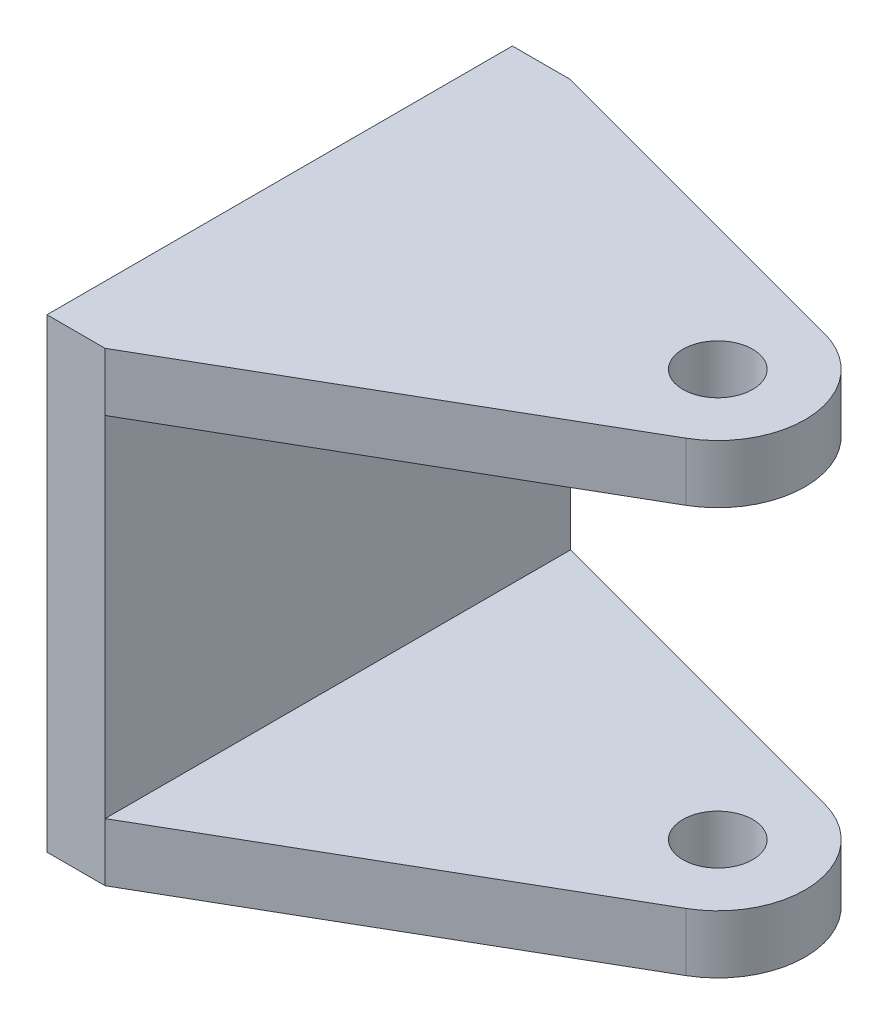
ISO-10303-21;
HEADER;
FILE_DESCRIPTION(('STEP AP214'),'2;1');
FILE_NAME('part.step','',(''),(''),'','','');
FILE_SCHEMA(('AUTOMOTIVE_DESIGN { 1 0 10303 214 1 1 1 1 }'));
ENDSEC;
DATA;
#1=APPLICATION_CONTEXT('core data for automotive mechanical design processes');
#2=APPLICATION_PROTOCOL_DEFINITION('international standard','automotive_design',2000,#1);
#3=PRODUCT_CONTEXT('',#1,'mechanical');
#4=PRODUCT('Part','Part','',(#3));
#5=PRODUCT_RELATED_PRODUCT_CATEGORY('part','',(#4));
#6=PRODUCT_DEFINITION_FORMATION('','',#4);
#7=PRODUCT_DEFINITION_CONTEXT('part definition',#1,'design');
#8=PRODUCT_DEFINITION('design','',#6,#7);
#9=PRODUCT_DEFINITION_SHAPE('','',#8);
#10=(LENGTH_UNIT() NAMED_UNIT(*) SI_UNIT(.MILLI.,.METRE.));
#11=(NAMED_UNIT(*) PLANE_ANGLE_UNIT() SI_UNIT($,.RADIAN.));
#12=(NAMED_UNIT(*) SI_UNIT($,.STERADIAN.) SOLID_ANGLE_UNIT());
#13=UNCERTAINTY_MEASURE_WITH_UNIT(LENGTH_MEASURE(1.E-05),#10,'distance_accuracy_value','');
#14=(GEOMETRIC_REPRESENTATION_CONTEXT(3) GLOBAL_UNCERTAINTY_ASSIGNED_CONTEXT((#13)) GLOBAL_UNIT_ASSIGNED_CONTEXT((#10,
#11,#12)) REPRESENTATION_CONTEXT('',''));
#15=CARTESIAN_POINT('',(0.,0.,0.));
#16=DIRECTION('',(0.,0.,1.));
#17=DIRECTION('',(1.,0.,0.));
#18=AXIS2_PLACEMENT_3D('',#15,#16,#17);
#19=CARTESIAN_POINT('',(65.7794620237371,30.,-9.52479549034592));
#20=DIRECTION('',(0.,1.,0.));
#21=DIRECTION('',(1.,0.,0.));
#22=AXIS2_PLACEMENT_3D('',#19,#20,#21);
#23=PLANE('',#22);
#24=CARTESIAN_POINT('',(65.7794620237371,30.,-9.52479549034592));
#25=DIRECTION('',(0.,-1.,0.));
#26=DIRECTION('',(1.,0.,0.));
#27=AXIS2_PLACEMENT_3D('',#24,#25,#26);
#28=CIRCLE('',#27,6.);
#29=CARTESIAN_POINT('',(71.7794620237371,30.,-9.52479549034592));
#30=VERTEX_POINT('',#29);
#31=EDGE_CURVE('E10',#30,#30,#28,.T.);
#32=ORIENTED_EDGE('',*,*,#31,.F.);
#33=EDGE_LOOP('',(#32));
#34=FACE_BOUND('',#33,.T.);
#35=DIRECTION('',(-0.866025403784439,0.,0.5));
#36=VECTOR('',#35,1.);
#37=CARTESIAN_POINT('',(73.2794620237371,30.,3.46558556642067));
#38=LINE('',#37,#36);
#39=CARTESIAN_POINT('',(73.2794620237371,30.,3.46558556642067));
#40=VERTEX_POINT('',#39);
#41=CARTESIAN_POINT('',(10.,30.,40.));
#42=VERTEX_POINT('',#41);
#43=EDGE_CURVE('E133',#40,#42,#38,.T.);
#44=ORIENTED_EDGE('',*,*,#43,.T.);
#45=DIRECTION('',(0.,0.,-1.));
#46=VECTOR('',#45,1.);
#47=CARTESIAN_POINT('',(10.,30.,40.));
#48=LINE('',#47,#46);
#49=CARTESIAN_POINT('',(10.,30.,-40.));
#50=VERTEX_POINT('',#49);
#51=EDGE_CURVE('E137',#42,#50,#48,.T.);
#52=ORIENTED_EDGE('',*,*,#51,.T.);
#53=DIRECTION('',(0.965925826289068,0.,0.258819045102521));
#54=VECTOR('',#53,1.);
#55=CARTESIAN_POINT('',(10.,30.,-40.));
#56=LINE('',#55,#54);
#57=CARTESIAN_POINT('',(69.6617477002749,30.,-24.0136828846819));
#58=VERTEX_POINT('',#57);
#59=EDGE_CURVE('E224',#50,#58,#56,.T.);
#60=ORIENTED_EDGE('',*,*,#59,.T.);
#61=CARTESIAN_POINT('',(65.7794620237371,30.,-9.52479549034592));
#62=DIRECTION('',(0.,-1.,0.));
#63=DIRECTION('',(1.,0.,0.));
#64=AXIS2_PLACEMENT_3D('',#61,#62,#63);
#65=CIRCLE('',#64,15.);
#66=EDGE_CURVE('E26',#58,#40,#65,.T.);
#67=ORIENTED_EDGE('',*,*,#66,.T.);
#68=EDGE_LOOP('',(#44,#52,#60,#67));
#69=FACE_BOUND('',#68,.T.);
#70=ADVANCED_FACE('F17',(#34,#69),#23,.F.);
#71=CARTESIAN_POINT('',(65.7794620237371,40.,-9.52479549034592));
#72=DIRECTION('',(0.,-1.,0.));
#73=DIRECTION('',(0.,0.,1.));
#74=AXIS2_PLACEMENT_3D('',#71,#72,#73);
#75=CYLINDRICAL_SURFACE('',#74,6.);
#76=ORIENTED_EDGE('',*,*,#31,.T.);
#77=EDGE_LOOP('',(#76));
#78=FACE_BOUND('',#77,.T.);
#79=CARTESIAN_POINT('',(65.7794620237371,40.,-9.52479549034592));
#80=DIRECTION('',(0.,-1.,0.));
#81=DIRECTION('',(1.,0.,0.));
#82=AXIS2_PLACEMENT_3D('',#79,#80,#81);
#83=CIRCLE('',#82,6.);
#84=CARTESIAN_POINT('',(71.7794620237371,40.,-9.52479549034592));
#85=VERTEX_POINT('',#84);
#86=EDGE_CURVE('E209',#85,#85,#83,.T.);
#87=ORIENTED_EDGE('',*,*,#86,.F.);
#88=EDGE_LOOP('',(#87));
#89=FACE_BOUND('',#88,.T.);
#90=ADVANCED_FACE('F19',(#78,#89),#75,.F.);
#91=CARTESIAN_POINT('',(65.7794620237371,40.,-9.52479549034592));
#92=DIRECTION('',(0.,-1.,0.));
#93=DIRECTION('',(0.,0.,1.));
#94=AXIS2_PLACEMENT_3D('',#91,#92,#93);
#95=CYLINDRICAL_SURFACE('',#94,15.);
#96=ORIENTED_EDGE('',*,*,#66,.F.);
#97=DIRECTION('',(0.,-1.,0.));
#98=VECTOR('',#97,1.);
#99=CARTESIAN_POINT('',(69.6617477002749,40.,-24.0136828846819));
#100=LINE('',#99,#98);
#101=CARTESIAN_POINT('',(69.6617477002749,40.,-24.0136828846819));
#102=VERTEX_POINT('',#101);
#103=EDGE_CURVE('E226',#102,#58,#100,.T.);
#104=ORIENTED_EDGE('',*,*,#103,.F.);
#105=CARTESIAN_POINT('',(65.7794620237371,40.,-9.52479549034592));
#106=DIRECTION('',(0.,-1.,0.));
#107=DIRECTION('',(1.,0.,0.));
#108=AXIS2_PLACEMENT_3D('',#105,#106,#107);
#109=CIRCLE('',#108,15.);
#110=CARTESIAN_POINT('',(73.2794620237371,40.,3.46558556642067));
#111=VERTEX_POINT('',#110);
#112=EDGE_CURVE('E210',#102,#111,#109,.T.);
#113=ORIENTED_EDGE('',*,*,#112,.T.);
#114=DIRECTION('',(0.,-1.,0.));
#115=VECTOR('',#114,1.);
#116=CARTESIAN_POINT('',(73.2794620237371,40.,3.46558556642067));
#117=LINE('',#116,#115);
#118=EDGE_CURVE('E140',#111,#40,#117,.T.);
#119=ORIENTED_EDGE('',*,*,#118,.T.);
#120=EDGE_LOOP('',(#96,#104,#113,#119));
#121=FACE_BOUND('',#120,.T.);
#122=ADVANCED_FACE('F289',(#121),#95,.T.);
#123=CARTESIAN_POINT('',(10.,40.,-40.));
#124=DIRECTION('',(-0.258819045102521,0.,0.965925826289068));
#125=DIRECTION('',(0.,1.,0.));
#126=AXIS2_PLACEMENT_3D('',#123,#124,#125);
#127=PLANE('',#126);
#128=ORIENTED_EDGE('',*,*,#59,.F.);
#129=DIRECTION('',(0.,-1.,0.));
#130=VECTOR('',#129,1.);
#131=CARTESIAN_POINT('',(10.,40.,-40.));
#132=LINE('',#131,#130);
#133=CARTESIAN_POINT('',(10.,40.,-40.));
#134=VERTEX_POINT('',#133);
#135=EDGE_CURVE('E218',#134,#50,#132,.T.);
#136=ORIENTED_EDGE('',*,*,#135,.F.);
#137=DIRECTION('',(0.965925826289068,0.,0.258819045102521));
#138=VECTOR('',#137,1.);
#139=CARTESIAN_POINT('',(10.,40.,-40.));
#140=LINE('',#139,#138);
#141=EDGE_CURVE('E205',#134,#102,#140,.T.);
#142=ORIENTED_EDGE('',*,*,#141,.T.);
#143=ORIENTED_EDGE('',*,*,#103,.T.);
#144=EDGE_LOOP('',(#128,#136,#142,#143));
#145=FACE_BOUND('',#144,.T.);
#146=ADVANCED_FACE('F294',(#145),#127,.F.);
#147=CARTESIAN_POINT('',(73.2794620237371,40.,3.46558556642067));
#148=DIRECTION('',(-0.5,0.,-0.866025403784439));
#149=DIRECTION('',(-0.866025403784439,0.,0.5));
#150=AXIS2_PLACEMENT_3D('',#147,#148,#149);
#151=PLANE('',#150);
#152=ORIENTED_EDGE('',*,*,#43,.F.);
#153=ORIENTED_EDGE('',*,*,#118,.F.);
#154=DIRECTION('',(-0.866025403784439,0.,0.5));
#155=VECTOR('',#154,1.);
#156=CARTESIAN_POINT('',(73.2794620237371,40.,3.46558556642067));
#157=LINE('',#156,#155);
#158=CARTESIAN_POINT('',(10.,40.,40.));
#159=VERTEX_POINT('',#158);
#160=EDGE_CURVE('E148',#111,#159,#157,.T.);
#161=ORIENTED_EDGE('',*,*,#160,.T.);
#162=DIRECTION('',(0.,-1.,0.));
#163=VECTOR('',#162,1.);
#164=CARTESIAN_POINT('',(10.,40.,40.));
#165=LINE('',#164,#163);
#166=EDGE_CURVE('E144',#159,#42,#165,.T.);
#167=ORIENTED_EDGE('',*,*,#166,.T.);
#168=EDGE_LOOP('',(#152,#153,#161,#167));
#169=FACE_BOUND('',#168,.T.);
#170=ADVANCED_FACE('F146',(#169),#151,.F.);
#171=CARTESIAN_POINT('',(65.7794620237371,-30.,-9.52479549034592));
#172=DIRECTION('',(0.,-1.,0.));
#173=DIRECTION('',(0.,0.,-1.));
#174=AXIS2_PLACEMENT_3D('',#171,#172,#173);
#175=PLANE('',#174);
#176=CARTESIAN_POINT('',(65.7794620237371,-30.,-9.52479549034592));
#177=DIRECTION('',(0.,-1.,0.));
#178=DIRECTION('',(1.,0.,0.));
#179=AXIS2_PLACEMENT_3D('',#176,#177,#178);
#180=CIRCLE('',#179,6.);
#181=CARTESIAN_POINT('',(71.7794620237371,-30.,-9.52479549034592));
#182=VERTEX_POINT('',#181);
#183=EDGE_CURVE('E141',#182,#182,#180,.T.);
#184=ORIENTED_EDGE('',*,*,#183,.T.);
#185=EDGE_LOOP('',(#184));
#186=FACE_BOUND('',#185,.T.);
#187=DIRECTION('',(-0.866025403784439,0.,0.5));
#188=VECTOR('',#187,1.);
#189=CARTESIAN_POINT('',(73.2794620237371,-30.,3.46558556642067));
#190=LINE('',#189,#188);
#191=CARTESIAN_POINT('',(73.2794620237371,-30.,3.46558556642067));
#192=VERTEX_POINT('',#191);
#193=CARTESIAN_POINT('',(10.,-30.,40.));
#194=VERTEX_POINT('',#193);
#195=EDGE_CURVE('E254',#192,#194,#190,.T.);
#196=ORIENTED_EDGE('',*,*,#195,.F.);
#197=CARTESIAN_POINT('',(65.7794620237371,-30.,-9.52479549034592));
#198=DIRECTION('',(0.,-1.,0.));
#199=DIRECTION('',(1.,0.,0.));
#200=AXIS2_PLACEMENT_3D('',#197,#198,#199);
#201=CIRCLE('',#200,15.);
#202=CARTESIAN_POINT('',(69.6617477002749,-30.,-24.0136828846819));
#203=VERTEX_POINT('',#202);
#204=EDGE_CURVE('E262',#203,#192,#201,.T.);
#205=ORIENTED_EDGE('',*,*,#204,.F.);
#206=DIRECTION('',(0.965925826289068,0.,0.258819045102521));
#207=VECTOR('',#206,1.);
#208=CARTESIAN_POINT('',(10.,-30.,-40.));
#209=LINE('',#208,#207);
#210=CARTESIAN_POINT('',(10.,-30.,-40.));
#211=VERTEX_POINT('',#210);
#212=EDGE_CURVE('E243',#211,#203,#209,.T.);
#213=ORIENTED_EDGE('',*,*,#212,.F.);
#214=DIRECTION('',(0.,0.,-1.));
#215=VECTOR('',#214,1.);
#216=CARTESIAN_POINT('',(10.,-30.,40.));
#217=LINE('',#216,#215);
#218=EDGE_CURVE('E165',#194,#211,#217,.T.);
#219=ORIENTED_EDGE('',*,*,#218,.F.);
#220=EDGE_LOOP('',(#196,#205,#213,#219));
#221=FACE_BOUND('',#220,.T.);
#222=ADVANCED_FACE('F382',(#186,#221),#175,.F.);
#223=CARTESIAN_POINT('',(65.7794620237371,-40.,-9.52479549034592));
#224=DIRECTION('',(0.,1.,0.));
#225=DIRECTION('',(0.,0.,1.));
#226=AXIS2_PLACEMENT_3D('',#223,#224,#225);
#227=CYLINDRICAL_SURFACE('',#226,6.);
#228=ORIENTED_EDGE('',*,*,#183,.F.);
#229=EDGE_LOOP('',(#228));
#230=FACE_BOUND('',#229,.T.);
#231=CARTESIAN_POINT('',(65.7794620237371,-40.,-9.52479549034592));
#232=DIRECTION('',(0.,-1.,0.));
#233=DIRECTION('',(1.,0.,0.));
#234=AXIS2_PLACEMENT_3D('',#231,#232,#233);
#235=CIRCLE('',#234,6.);
#236=CARTESIAN_POINT('',(71.7794620237371,-40.,-9.52479549034592));
#237=VERTEX_POINT('',#236);
#238=EDGE_CURVE('E238',#237,#237,#235,.T.);
#239=ORIENTED_EDGE('',*,*,#238,.T.);
#240=EDGE_LOOP('',(#239));
#241=FACE_BOUND('',#240,.T.);
#242=ADVANCED_FACE('F372',(#230,#241),#227,.F.);
#243=CARTESIAN_POINT('',(65.7794620237371,-40.,-9.52479549034592));
#244=DIRECTION('',(0.,1.,0.));
#245=DIRECTION('',(0.,0.,1.));
#246=AXIS2_PLACEMENT_3D('',#243,#244,#245);
#247=CYLINDRICAL_SURFACE('',#246,15.);
#248=ORIENTED_EDGE('',*,*,#204,.T.);
#249=DIRECTION('',(0.,1.,0.));
#250=VECTOR('',#249,1.);
#251=CARTESIAN_POINT('',(73.2794620237371,-40.,3.46558556642067));
#252=LINE('',#251,#250);
#253=CARTESIAN_POINT('',(73.2794620237371,-40.,3.46558556642067));
#254=VERTEX_POINT('',#253);
#255=EDGE_CURVE('E248',#254,#192,#252,.T.);
#256=ORIENTED_EDGE('',*,*,#255,.F.);
#257=CARTESIAN_POINT('',(65.7794620237371,-40.,-9.52479549034592));
#258=DIRECTION('',(0.,-1.,0.));
#259=DIRECTION('',(1.,0.,0.));
#260=AXIS2_PLACEMENT_3D('',#257,#258,#259);
#261=CIRCLE('',#260,15.);
#262=CARTESIAN_POINT('',(69.6617477002749,-40.,-24.0136828846819));
#263=VERTEX_POINT('',#262);
#264=EDGE_CURVE('E231',#263,#254,#261,.T.);
#265=ORIENTED_EDGE('',*,*,#264,.F.);
#266=DIRECTION('',(0.,1.,0.));
#267=VECTOR('',#266,1.);
#268=CARTESIAN_POINT('',(69.6617477002749,-40.,-24.0136828846819));
#269=LINE('',#268,#267);
#270=EDGE_CURVE('E247',#263,#203,#269,.T.);
#271=ORIENTED_EDGE('',*,*,#270,.T.);
#272=EDGE_LOOP('',(#248,#256,#265,#271));
#273=FACE_BOUND('',#272,.T.);
#274=ADVANCED_FACE('F317',(#273),#247,.T.);
#275=CARTESIAN_POINT('',(10.,-40.,-40.));
#276=DIRECTION('',(-0.258819045102521,0.,0.965925826289068));
#277=DIRECTION('',(0.,1.,0.));
#278=AXIS2_PLACEMENT_3D('',#275,#276,#277);
#279=PLANE('',#278);
#280=ORIENTED_EDGE('',*,*,#212,.T.);
#281=ORIENTED_EDGE('',*,*,#270,.F.);
#282=DIRECTION('',(0.965925826289068,0.,0.258819045102521));
#283=VECTOR('',#282,1.);
#284=CARTESIAN_POINT('',(10.,-40.,-40.));
#285=LINE('',#284,#283);
#286=CARTESIAN_POINT('',(10.,-40.,-40.));
#287=VERTEX_POINT('',#286);
#288=EDGE_CURVE('E152',#287,#263,#285,.T.);
#289=ORIENTED_EDGE('',*,*,#288,.F.);
#290=DIRECTION('',(0.,1.,0.));
#291=VECTOR('',#290,1.);
#292=CARTESIAN_POINT('',(10.,-40.,-40.));
#293=LINE('',#292,#291);
#294=EDGE_CURVE('E178',#287,#211,#293,.T.);
#295=ORIENTED_EDGE('',*,*,#294,.T.);
#296=EDGE_LOOP('',(#280,#281,#289,#295));
#297=FACE_BOUND('',#296,.T.);
#298=ADVANCED_FACE('F311',(#297),#279,.F.);
#299=CARTESIAN_POINT('',(73.2794620237371,-40.,3.46558556642067));
#300=DIRECTION('',(-0.5,0.,-0.866025403784439));
#301=DIRECTION('',(-0.866025403784439,0.,0.5));
#302=AXIS2_PLACEMENT_3D('',#299,#300,#301);
#303=PLANE('',#302);
#304=ORIENTED_EDGE('',*,*,#195,.T.);
#305=DIRECTION('',(0.,1.,0.));
#306=VECTOR('',#305,1.);
#307=CARTESIAN_POINT('',(10.,-40.,40.));
#308=LINE('',#307,#306);
#309=CARTESIAN_POINT('',(10.,-40.,40.));
#310=VERTEX_POINT('',#309);
#311=EDGE_CURVE('E153',#310,#194,#308,.T.);
#312=ORIENTED_EDGE('',*,*,#311,.F.);
#313=DIRECTION('',(-0.866025403784439,0.,0.5));
#314=VECTOR('',#313,1.);
#315=CARTESIAN_POINT('',(73.2794620237371,-40.,3.46558556642067));
#316=LINE('',#315,#314);
#317=EDGE_CURVE('E235',#254,#310,#316,.T.);
#318=ORIENTED_EDGE('',*,*,#317,.F.);
#319=ORIENTED_EDGE('',*,*,#255,.T.);
#320=EDGE_LOOP('',(#304,#312,#318,#319));
#321=FACE_BOUND('',#320,.T.);
#322=ADVANCED_FACE('F316',(#321),#303,.F.);
#323=CARTESIAN_POINT('',(0.,40.,-40.));
#324=DIRECTION('',(0.,-1.,0.));
#325=DIRECTION('',(0.,0.,-1.));
#326=AXIS2_PLACEMENT_3D('',#323,#324,#325);
#327=PLANE('',#326);
#328=ORIENTED_EDGE('',*,*,#86,.T.);
#329=EDGE_LOOP('',(#328));
#330=FACE_BOUND('',#329,.T.);
#331=DIRECTION('',(0.,0.,-1.));
#332=VECTOR('',#331,1.);
#333=CARTESIAN_POINT('',(0.,40.,40.));
#334=LINE('',#333,#332);
#335=CARTESIAN_POINT('',(0.,40.,40.));
#336=VERTEX_POINT('',#335);
#337=CARTESIAN_POINT('',(0.,40.,-40.));
#338=VERTEX_POINT('',#337);
#339=EDGE_CURVE('E190',#336,#338,#334,.T.);
#340=ORIENTED_EDGE('',*,*,#339,.F.);
#341=DIRECTION('',(-1.,0.,0.));
#342=VECTOR('',#341,1.);
#343=CARTESIAN_POINT('',(10.,40.,40.));
#344=LINE('',#343,#342);
#345=EDGE_CURVE('E185',#159,#336,#344,.T.);
#346=ORIENTED_EDGE('',*,*,#345,.F.);
#347=ORIENTED_EDGE('',*,*,#160,.F.);
#348=ORIENTED_EDGE('',*,*,#112,.F.);
#349=ORIENTED_EDGE('',*,*,#141,.F.);
#350=DIRECTION('',(1.,0.,0.));
#351=VECTOR('',#350,1.);
#352=CARTESIAN_POINT('',(0.,40.,-40.));
#353=LINE('',#352,#351);
#354=EDGE_CURVE('E214',#338,#134,#353,.T.);
#355=ORIENTED_EDGE('',*,*,#354,.F.);
#356=EDGE_LOOP('',(#340,#346,#347,#348,#349,#355));
#357=FACE_BOUND('',#356,.T.);
#358=ADVANCED_FACE('F328',(#330,#357),#327,.F.);
#359=CARTESIAN_POINT('',(0.,-40.,-40.));
#360=DIRECTION('',(0.,-1.,0.));
#361=DIRECTION('',(0.,0.,-1.));
#362=AXIS2_PLACEMENT_3D('',#359,#360,#361);
#363=PLANE('',#362);
#364=ORIENTED_EDGE('',*,*,#238,.F.);
#365=EDGE_LOOP('',(#364));
#366=FACE_BOUND('',#365,.T.);
#367=DIRECTION('',(0.,0.,-1.));
#368=VECTOR('',#367,1.);
#369=CARTESIAN_POINT('',(0.,-40.,40.));
#370=LINE('',#369,#368);
#371=CARTESIAN_POINT('',(0.,-40.,40.));
#372=VERTEX_POINT('',#371);
#373=CARTESIAN_POINT('',(0.,-40.,-40.));
#374=VERTEX_POINT('',#373);
#375=EDGE_CURVE('E193',#372,#374,#370,.T.);
#376=ORIENTED_EDGE('',*,*,#375,.T.);
#377=DIRECTION('',(1.,0.,0.));
#378=VECTOR('',#377,1.);
#379=CARTESIAN_POINT('',(0.,-40.,-40.));
#380=LINE('',#379,#378);
#381=EDGE_CURVE('E181',#374,#287,#380,.T.);
#382=ORIENTED_EDGE('',*,*,#381,.T.);
#383=ORIENTED_EDGE('',*,*,#288,.T.);
#384=ORIENTED_EDGE('',*,*,#264,.T.);
#385=ORIENTED_EDGE('',*,*,#317,.T.);
#386=DIRECTION('',(-1.,0.,0.));
#387=VECTOR('',#386,1.);
#388=CARTESIAN_POINT('',(10.,-40.,40.));
#389=LINE('',#388,#387);
#390=EDGE_CURVE('E179',#310,#372,#389,.T.);
#391=ORIENTED_EDGE('',*,*,#390,.T.);
#392=EDGE_LOOP('',(#376,#382,#383,#384,#385,#391));
#393=FACE_BOUND('',#392,.T.);
#394=ADVANCED_FACE('F347',(#366,#393),#363,.T.);
#395=CARTESIAN_POINT('',(10.,-40.,40.));
#396=DIRECTION('',(0.,0.,-1.));
#397=DIRECTION('',(0.,-1.,0.));
#398=AXIS2_PLACEMENT_3D('',#395,#396,#397);
#399=PLANE('',#398);
#400=ORIENTED_EDGE('',*,*,#345,.T.);
#401=DIRECTION('',(0.,1.,0.));
#402=VECTOR('',#401,1.);
#403=CARTESIAN_POINT('',(0.,-40.,40.));
#404=LINE('',#403,#402);
#405=EDGE_CURVE('E196',#372,#336,#404,.T.);
#406=ORIENTED_EDGE('',*,*,#405,.F.);
#407=ORIENTED_EDGE('',*,*,#390,.F.);
#408=ORIENTED_EDGE('',*,*,#311,.T.);
#409=DIRECTION('',(0.,1.,0.));
#410=VECTOR('',#409,1.);
#411=CARTESIAN_POINT('',(10.,-40.,40.));
#412=LINE('',#411,#410);
#413=EDGE_CURVE('E157',#194,#42,#412,.T.);
#414=ORIENTED_EDGE('',*,*,#413,.T.);
#415=ORIENTED_EDGE('',*,*,#166,.F.);
#416=EDGE_LOOP('',(#400,#406,#407,#408,#414,#415));
#417=FACE_BOUND('',#416,.T.);
#418=ADVANCED_FACE('F158',(#417),#399,.F.);
#419=CARTESIAN_POINT('',(0.,-40.,-40.));
#420=DIRECTION('',(0.,0.,1.));
#421=DIRECTION('',(1.,0.,0.));
#422=AXIS2_PLACEMENT_3D('',#419,#420,#421);
#423=PLANE('',#422);
#424=ORIENTED_EDGE('',*,*,#354,.T.);
#425=ORIENTED_EDGE('',*,*,#135,.T.);
#426=DIRECTION('',(0.,1.,0.));
#427=VECTOR('',#426,1.);
#428=CARTESIAN_POINT('',(10.,-40.,-40.));
#429=LINE('',#428,#427);
#430=EDGE_CURVE('E170',#211,#50,#429,.T.);
#431=ORIENTED_EDGE('',*,*,#430,.F.);
#432=ORIENTED_EDGE('',*,*,#294,.F.);
#433=ORIENTED_EDGE('',*,*,#381,.F.);
#434=DIRECTION('',(0.,1.,0.));
#435=VECTOR('',#434,1.);
#436=CARTESIAN_POINT('',(0.,-40.,-40.));
#437=LINE('',#436,#435);
#438=EDGE_CURVE('E197',#374,#338,#437,.T.);
#439=ORIENTED_EDGE('',*,*,#438,.T.);
#440=EDGE_LOOP('',(#424,#425,#431,#432,#433,#439));
#441=FACE_BOUND('',#440,.T.);
#442=ADVANCED_FACE('F304',(#441),#423,.F.);
#443=CARTESIAN_POINT('',(0.,-40.,40.));
#444=DIRECTION('',(1.,0.,0.));
#445=DIRECTION('',(0.,0.,-1.));
#446=AXIS2_PLACEMENT_3D('',#443,#444,#445);
#447=PLANE('',#446);
#448=ORIENTED_EDGE('',*,*,#339,.T.);
#449=ORIENTED_EDGE('',*,*,#438,.F.);
#450=ORIENTED_EDGE('',*,*,#375,.F.);
#451=ORIENTED_EDGE('',*,*,#405,.T.);
#452=EDGE_LOOP('',(#448,#449,#450,#451));
#453=FACE_BOUND('',#452,.T.);
#454=ADVANCED_FACE('F282',(#453),#447,.F.);
#455=CARTESIAN_POINT('',(10.,-40.,-40.));
#456=DIRECTION('',(-1.,0.,0.));
#457=DIRECTION('',(0.,1.,0.));
#458=AXIS2_PLACEMENT_3D('',#455,#456,#457);
#459=PLANE('',#458);
#460=ORIENTED_EDGE('',*,*,#51,.F.);
#461=ORIENTED_EDGE('',*,*,#413,.F.);
#462=ORIENTED_EDGE('',*,*,#218,.T.);
#463=ORIENTED_EDGE('',*,*,#430,.T.);
#464=EDGE_LOOP('',(#460,#461,#462,#463));
#465=FACE_BOUND('',#464,.T.);
#466=ADVANCED_FACE('F168',(#465),#459,.F.);
#467=CLOSED_SHELL('',(#70,#90,#122,#146,#170,#222,#242,#274,#298,#322,#358,#394,#418,#442,#454,#466));
#468=MANIFOLD_SOLID_BREP('B1',#467);
#469=ADVANCED_BREP_SHAPE_REPRESENTATION('',(#18,#468),#14);
#470=SHAPE_DEFINITION_REPRESENTATION(#9,#469);
ENDSEC;
END-ISO-10303-21;
